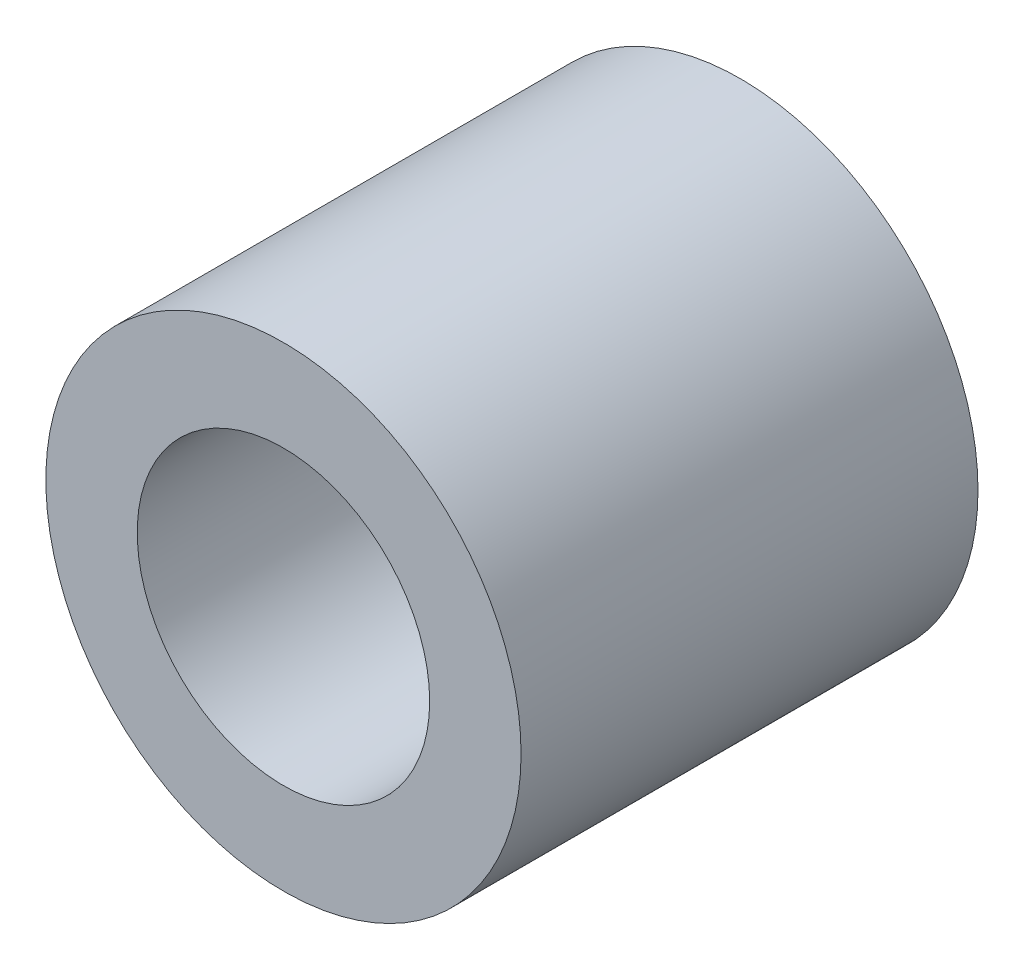
ISO-10303-21;
HEADER;
FILE_DESCRIPTION(('STEP AP214'),'2;1');
FILE_NAME('part.step','',(''),(''),'','','');
FILE_SCHEMA(('AUTOMOTIVE_DESIGN { 1 0 10303 214 1 1 1 1 }'));
ENDSEC;
DATA;
#1=APPLICATION_CONTEXT('core data for automotive mechanical design processes');
#2=APPLICATION_PROTOCOL_DEFINITION('international standard','automotive_design',2000,#1);
#3=PRODUCT_CONTEXT('',#1,'mechanical');
#4=PRODUCT('Part','Part','',(#3));
#5=PRODUCT_RELATED_PRODUCT_CATEGORY('part','',(#4));
#6=PRODUCT_DEFINITION_FORMATION('','',#4);
#7=PRODUCT_DEFINITION_CONTEXT('part definition',#1,'design');
#8=PRODUCT_DEFINITION('design','',#6,#7);
#9=PRODUCT_DEFINITION_SHAPE('','',#8);
#10=(LENGTH_UNIT() NAMED_UNIT(*) SI_UNIT(.MILLI.,.METRE.));
#11=(NAMED_UNIT(*) PLANE_ANGLE_UNIT() SI_UNIT($,.RADIAN.));
#12=(NAMED_UNIT(*) SI_UNIT($,.STERADIAN.) SOLID_ANGLE_UNIT());
#13=UNCERTAINTY_MEASURE_WITH_UNIT(LENGTH_MEASURE(1.E-05),#10,'distance_accuracy_value','');
#14=(GEOMETRIC_REPRESENTATION_CONTEXT(3) GLOBAL_UNCERTAINTY_ASSIGNED_CONTEXT((#13)) GLOBAL_UNIT_ASSIGNED_CONTEXT((#10,
#11,#12)) REPRESENTATION_CONTEXT('',''));
#15=CARTESIAN_POINT('',(0.,0.,0.));
#16=DIRECTION('',(0.,0.,1.));
#17=DIRECTION('',(1.,0.,0.));
#18=AXIS2_PLACEMENT_3D('',#15,#16,#17);
#19=CARTESIAN_POINT('',(1.45000000003573,330.999999999972,5.));
#20=DIRECTION('',(0.,0.,-1.));
#21=DIRECTION('',(-1.,0.,0.));
#22=AXIS2_PLACEMENT_3D('',#19,#20,#21);
#23=CYLINDRICAL_SURFACE('',#22,2.6);
#24=CARTESIAN_POINT('',(1.45000000003573,330.999999999972,5.));
#25=DIRECTION('',(0.,0.,1.));
#26=DIRECTION('',(1.,0.,0.));
#27=AXIS2_PLACEMENT_3D('',#24,#25,#26);
#28=CIRCLE('',#27,2.6);
#29=CARTESIAN_POINT('',(4.05000000003572,330.999999999972,5.));
#30=VERTEX_POINT('',#29);
#31=EDGE_CURVE('E10',#30,#30,#28,.T.);
#32=ORIENTED_EDGE('',*,*,#31,.F.);
#33=EDGE_LOOP('',(#32));
#34=FACE_BOUND('',#33,.T.);
#35=CARTESIAN_POINT('',(1.45000000003573,330.999999999972,0.));
#36=DIRECTION('',(0.,0.,1.));
#37=DIRECTION('',(1.,0.,0.));
#38=AXIS2_PLACEMENT_3D('',#35,#36,#37);
#39=CIRCLE('',#38,2.6);
#40=CARTESIAN_POINT('',(4.05000000003572,330.999999999972,0.));
#41=VERTEX_POINT('',#40);
#42=EDGE_CURVE('E35',#41,#41,#39,.T.);
#43=ORIENTED_EDGE('',*,*,#42,.T.);
#44=EDGE_LOOP('',(#43));
#45=FACE_BOUND('',#44,.T.);
#46=ADVANCED_FACE('F32',(#34,#45),#23,.T.);
#47=CARTESIAN_POINT('',(1.45000000003573,330.999999999972,5.));
#48=DIRECTION('',(0.,0.,1.));
#49=DIRECTION('',(1.,0.,0.));
#50=AXIS2_PLACEMENT_3D('',#47,#48,#49);
#51=PLANE('',#50);
#52=CARTESIAN_POINT('',(1.45000000003573,330.999999999972,5.));
#53=DIRECTION('',(0.,0.,1.));
#54=DIRECTION('',(1.,0.,0.));
#55=AXIS2_PLACEMENT_3D('',#52,#53,#54);
#56=CIRCLE('',#55,1.6);
#57=CARTESIAN_POINT('',(3.05000000003573,330.999999999972,5.));
#58=VERTEX_POINT('',#57);
#59=EDGE_CURVE('E46',#58,#58,#56,.T.);
#60=ORIENTED_EDGE('',*,*,#59,.F.);
#61=EDGE_LOOP('',(#60));
#62=FACE_BOUND('',#61,.T.);
#63=ORIENTED_EDGE('',*,*,#31,.T.);
#64=EDGE_LOOP('',(#63));
#65=FACE_BOUND('',#64,.T.);
#66=ADVANCED_FACE('F53',(#62,#65),#51,.T.);
#67=CARTESIAN_POINT('',(1.45000000003573,330.999999999972,0.));
#68=DIRECTION('',(0.,0.,1.));
#69=DIRECTION('',(1.,0.,0.));
#70=AXIS2_PLACEMENT_3D('',#67,#68,#69);
#71=PLANE('',#70);
#72=CARTESIAN_POINT('',(1.45000000003573,330.999999999972,0.));
#73=DIRECTION('',(0.,0.,1.));
#74=DIRECTION('',(1.,0.,0.));
#75=AXIS2_PLACEMENT_3D('',#72,#73,#74);
#76=CIRCLE('',#75,1.6);
#77=CARTESIAN_POINT('',(3.05000000003572,330.999999999972,0.));
#78=VERTEX_POINT('',#77);
#79=EDGE_CURVE('E42',#78,#78,#76,.T.);
#80=ORIENTED_EDGE('',*,*,#79,.T.);
#81=EDGE_LOOP('',(#80));
#82=FACE_BOUND('',#81,.T.);
#83=ORIENTED_EDGE('',*,*,#42,.F.);
#84=EDGE_LOOP('',(#83));
#85=FACE_BOUND('',#84,.T.);
#86=ADVANCED_FACE('F55',(#82,#85),#71,.F.);
#87=CARTESIAN_POINT('',(1.45000000003573,330.999999999972,5.));
#88=DIRECTION('',(0.,0.,1.));
#89=DIRECTION('',(1.,0.,0.));
#90=AXIS2_PLACEMENT_3D('',#87,#88,#89);
#91=CYLINDRICAL_SURFACE('',#90,1.6);
#92=ORIENTED_EDGE('',*,*,#59,.T.);
#93=EDGE_LOOP('',(#92));
#94=FACE_BOUND('',#93,.T.);
#95=ORIENTED_EDGE('',*,*,#79,.F.);
#96=EDGE_LOOP('',(#95));
#97=FACE_BOUND('',#96,.T.);
#98=ADVANCED_FACE('F50',(#94,#97),#91,.F.);
#99=CLOSED_SHELL('',(#46,#66,#86,#98));
#100=MANIFOLD_SOLID_BREP('B2',#99);
#101=ADVANCED_BREP_SHAPE_REPRESENTATION('',(#18,#100),#14);
#102=SHAPE_DEFINITION_REPRESENTATION(#9,#101);
ENDSEC;
END-ISO-10303-21;
